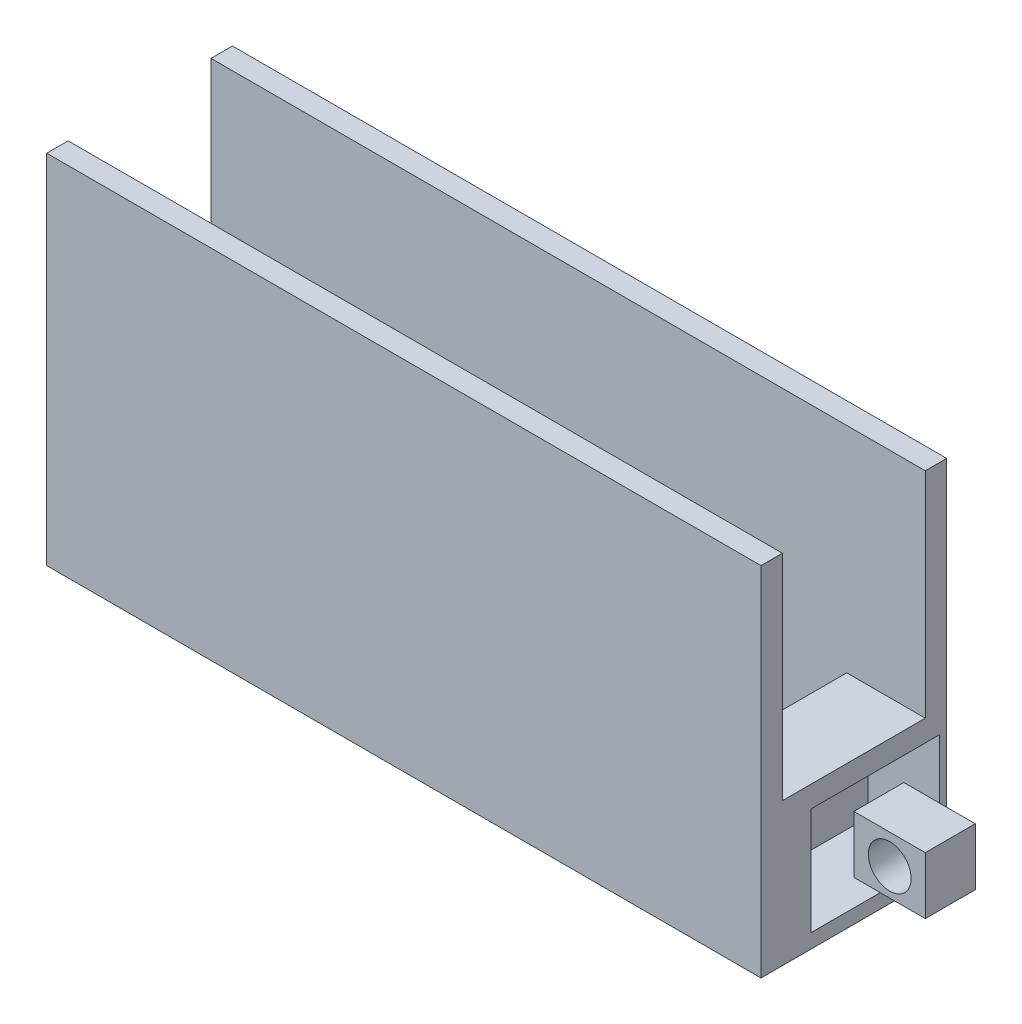
ISO-10303-21;
HEADER;
FILE_DESCRIPTION(('STEP AP214'),'2;1');
FILE_NAME('part.step','',(''),(''),'','','');
FILE_SCHEMA(('AUTOMOTIVE_DESIGN { 1 0 10303 214 1 1 1 1 }'));
ENDSEC;
DATA;
#1=APPLICATION_CONTEXT('core data for automotive mechanical design processes');
#2=APPLICATION_PROTOCOL_DEFINITION('international standard','automotive_design',2000,#1);
#3=PRODUCT_CONTEXT('',#1,'mechanical');
#4=PRODUCT('Part','Part','',(#3));
#5=PRODUCT_RELATED_PRODUCT_CATEGORY('part','',(#4));
#6=PRODUCT_DEFINITION_FORMATION('','',#4);
#7=PRODUCT_DEFINITION_CONTEXT('part definition',#1,'design');
#8=PRODUCT_DEFINITION('design','',#6,#7);
#9=PRODUCT_DEFINITION_SHAPE('','',#8);
#10=(LENGTH_UNIT() NAMED_UNIT(*) SI_UNIT(.MILLI.,.METRE.));
#11=(NAMED_UNIT(*) PLANE_ANGLE_UNIT() SI_UNIT($,.RADIAN.));
#12=(NAMED_UNIT(*) SI_UNIT($,.STERADIAN.) SOLID_ANGLE_UNIT());
#13=UNCERTAINTY_MEASURE_WITH_UNIT(LENGTH_MEASURE(1.E-05),#10,'distance_accuracy_value','');
#14=(GEOMETRIC_REPRESENTATION_CONTEXT(3) GLOBAL_UNCERTAINTY_ASSIGNED_CONTEXT((#13)) GLOBAL_UNIT_ASSIGNED_CONTEXT((#10,
#11,#12)) REPRESENTATION_CONTEXT('',''));
#15=CARTESIAN_POINT('',(0.,0.,0.));
#16=DIRECTION('',(0.,0.,1.));
#17=DIRECTION('',(1.,0.,0.));
#18=AXIS2_PLACEMENT_3D('',#15,#16,#17);
#19=CARTESIAN_POINT('',(0.,2.,0.));
#20=DIRECTION('',(0.,1.,0.));
#21=DIRECTION('',(0.,0.,1.));
#22=AXIS2_PLACEMENT_3D('',#19,#20,#21);
#23=PLANE('',#22);
#24=DIRECTION('',(-1.,0.,0.));
#25=VECTOR('',#24,1.);
#26=CARTESIAN_POINT('',(12.5280387960091,2.,0.3));
#27=LINE('',#26,#25);
#28=CARTESIAN_POINT('',(22.5280387960091,2.,0.3));
#29=VERTEX_POINT('',#28);
#30=CARTESIAN_POINT('',(21.4280387960091,2.,0.299999999999994));
#31=VERTEX_POINT('',#30);
#32=EDGE_CURVE('E216',#29,#31,#27,.T.);
#33=ORIENTED_EDGE('',*,*,#32,.T.);
#34=DIRECTION('',(0.,0.,-1.));
#35=VECTOR('',#34,1.);
#36=CARTESIAN_POINT('',(21.4280387960091,2.,0.4));
#37=LINE('',#36,#35);
#38=CARTESIAN_POINT('',(21.4280387960091,2.,2.29999999999999));
#39=VERTEX_POINT('',#38);
#40=EDGE_CURVE('E278',#39,#31,#37,.T.);
#41=ORIENTED_EDGE('',*,*,#40,.F.);
#42=DIRECTION('',(1.,0.,0.));
#43=VECTOR('',#42,1.);
#44=CARTESIAN_POINT('',(12.5280387960091,2.,2.3));
#45=LINE('',#44,#43);
#46=CARTESIAN_POINT('',(22.5280387960091,2.,2.3));
#47=VERTEX_POINT('',#46);
#48=EDGE_CURVE('E209',#39,#47,#45,.T.);
#49=ORIENTED_EDGE('',*,*,#48,.T.);
#50=DIRECTION('',(0.,0.,-1.));
#51=VECTOR('',#50,1.);
#52=CARTESIAN_POINT('',(22.5280387960091,2.,0.3));
#53=LINE('',#52,#51);
#54=EDGE_CURVE('E220',#47,#29,#53,.T.);
#55=ORIENTED_EDGE('',*,*,#54,.T.);
#56=EDGE_LOOP('',(#33,#41,#49,#55));
#57=FACE_BOUND('',#56,.T.);
#58=ADVANCED_FACE('F43',(#57),#23,.T.);
#59=CARTESIAN_POINT('',(22.5280387960091,7.,0.));
#60=DIRECTION('',(-1.,0.,0.));
#61=DIRECTION('',(0.,0.,1.));
#62=AXIS2_PLACEMENT_3D('',#59,#60,#61);
#63=PLANE('',#62);
#64=DIRECTION('',(0.,0.,-1.));
#65=VECTOR('',#64,1.);
#66=CARTESIAN_POINT('',(22.5280387960091,0.2,1.9));
#67=LINE('',#66,#65);
#68=CARTESIAN_POINT('',(22.5280387960091,0.2,1.9));
#69=VERTEX_POINT('',#68);
#70=CARTESIAN_POINT('',(22.5280387960091,0.2,0.0999999999999998));
#71=VERTEX_POINT('',#70);
#72=EDGE_CURVE('E227',#69,#71,#67,.T.);
#73=ORIENTED_EDGE('',*,*,#72,.F.);
#74=DIRECTION('',(0.,-1.,0.));
#75=VECTOR('',#74,1.);
#76=CARTESIAN_POINT('',(22.5280387960091,1.7,1.9));
#77=LINE('',#76,#75);
#78=CARTESIAN_POINT('',(22.5280387960091,1.7,1.9));
#79=VERTEX_POINT('',#78);
#80=EDGE_CURVE('E219',#79,#69,#77,.T.);
#81=ORIENTED_EDGE('',*,*,#80,.F.);
#82=DIRECTION('',(0.,0.,1.));
#83=VECTOR('',#82,1.);
#84=CARTESIAN_POINT('',(22.5280387960091,1.7,1.9));
#85=LINE('',#84,#83);
#86=CARTESIAN_POINT('',(22.5280387960091,1.7,0.1));
#87=VERTEX_POINT('',#86);
#88=EDGE_CURVE('E233',#87,#79,#85,.T.);
#89=ORIENTED_EDGE('',*,*,#88,.F.);
#90=DIRECTION('',(0.,1.,0.));
#91=VECTOR('',#90,1.);
#92=CARTESIAN_POINT('',(22.5280387960091,1.7,0.1));
#93=LINE('',#92,#91);
#94=EDGE_CURVE('E230',#71,#87,#93,.T.);
#95=ORIENTED_EDGE('',*,*,#94,.F.);
#96=EDGE_LOOP('',(#73,#81,#89,#95));
#97=FACE_BOUND('',#96,.T.);
#98=DIRECTION('',(0.,-1.,0.));
#99=VECTOR('',#98,1.);
#100=CARTESIAN_POINT('',(22.5280387960091,7.,0.));
#101=LINE('',#100,#99);
#102=CARTESIAN_POINT('',(22.5280387960091,5.,0.));
#103=VERTEX_POINT('',#102);
#104=CARTESIAN_POINT('',(22.5280387960091,0.,0.));
#105=VERTEX_POINT('',#104);
#106=EDGE_CURVE('E179',#103,#105,#101,.T.);
#107=ORIENTED_EDGE('',*,*,#106,.F.);
#108=DIRECTION('',(0.,0.,-1.));
#109=VECTOR('',#108,1.);
#110=CARTESIAN_POINT('',(22.5280387960091,5.,10.));
#111=LINE('',#110,#109);
#112=CARTESIAN_POINT('',(22.5280387960091,5.,0.3));
#113=VERTEX_POINT('',#112);
#114=EDGE_CURVE('E165',#113,#103,#111,.T.);
#115=ORIENTED_EDGE('',*,*,#114,.F.);
#116=DIRECTION('',(0.,1.,0.));
#117=VECTOR('',#116,1.);
#118=CARTESIAN_POINT('',(22.5280387960091,2.,0.3));
#119=LINE('',#118,#117);
#120=EDGE_CURVE('E187',#29,#113,#119,.T.);
#121=ORIENTED_EDGE('',*,*,#120,.F.);
#122=ORIENTED_EDGE('',*,*,#54,.F.);
#123=DIRECTION('',(0.,1.,0.));
#124=VECTOR('',#123,1.);
#125=CARTESIAN_POINT('',(22.5280387960091,2.,2.3));
#126=LINE('',#125,#124);
#127=CARTESIAN_POINT('',(22.5280387960091,5.,2.3));
#128=VERTEX_POINT('',#127);
#129=EDGE_CURVE('E210',#47,#128,#126,.T.);
#130=ORIENTED_EDGE('',*,*,#129,.T.);
#131=CARTESIAN_POINT('',(22.5280387960091,5.,2.6));
#132=VERTEX_POINT('',#131);
#133=EDGE_CURVE('E66',#132,#128,#111,.T.);
#134=ORIENTED_EDGE('',*,*,#133,.F.);
#135=DIRECTION('',(0.,-1.,0.));
#136=VECTOR('',#135,1.);
#137=CARTESIAN_POINT('',(22.5280387960091,7.,2.6));
#138=LINE('',#137,#136);
#139=CARTESIAN_POINT('',(22.5280387960091,0.,2.6));
#140=VERTEX_POINT('',#139);
#141=EDGE_CURVE('E196',#132,#140,#138,.T.);
#142=ORIENTED_EDGE('',*,*,#141,.T.);
#143=DIRECTION('',(0.,0.,-1.));
#144=VECTOR('',#143,1.);
#145=CARTESIAN_POINT('',(22.5280387960091,0.,0.));
#146=LINE('',#145,#144);
#147=EDGE_CURVE('E185',#140,#105,#146,.T.);
#148=ORIENTED_EDGE('',*,*,#147,.T.);
#149=EDGE_LOOP('',(#107,#115,#121,#122,#130,#134,#142,#148));
#150=FACE_BOUND('',#149,.T.);
#151=ADVANCED_FACE('F183',(#97,#150),#63,.F.);
#152=CARTESIAN_POINT('',(12.5280387960091,7.,0.));
#153=DIRECTION('',(1.,0.,0.));
#154=DIRECTION('',(0.,0.,-1.));
#155=AXIS2_PLACEMENT_3D('',#152,#153,#154);
#156=PLANE('',#155);
#157=DIRECTION('',(0.,-1.,0.));
#158=VECTOR('',#157,1.);
#159=CARTESIAN_POINT('',(12.5280387960091,7.,2.6));
#160=LINE('',#159,#158);
#161=CARTESIAN_POINT('',(12.5280387960091,5.,2.6));
#162=VERTEX_POINT('',#161);
#163=CARTESIAN_POINT('',(12.5280387960091,0.,2.6));
#164=VERTEX_POINT('',#163);
#165=EDGE_CURVE('E192',#162,#164,#160,.T.);
#166=ORIENTED_EDGE('',*,*,#165,.F.);
#167=DIRECTION('',(0.,0.,-1.));
#168=VECTOR('',#167,1.);
#169=CARTESIAN_POINT('',(12.5280387960091,5.,10.));
#170=LINE('',#169,#168);
#171=CARTESIAN_POINT('',(12.5280387960091,5.,2.3));
#172=VERTEX_POINT('',#171);
#173=EDGE_CURVE('E303',#162,#172,#170,.T.);
#174=ORIENTED_EDGE('',*,*,#173,.T.);
#175=DIRECTION('',(0.,1.,0.));
#176=VECTOR('',#175,1.);
#177=CARTESIAN_POINT('',(12.5280387960091,2.,2.3));
#178=LINE('',#177,#176);
#179=CARTESIAN_POINT('',(12.5280387960091,0.2,2.3));
#180=VERTEX_POINT('',#179);
#181=EDGE_CURVE('E190',#180,#172,#178,.T.);
#182=ORIENTED_EDGE('',*,*,#181,.F.);
#183=DIRECTION('',(0.,0.,1.));
#184=VECTOR('',#183,1.);
#185=CARTESIAN_POINT('',(12.5280387960091,0.2,0.3));
#186=LINE('',#185,#184);
#187=CARTESIAN_POINT('',(12.5280387960091,0.2,0.3));
#188=VERTEX_POINT('',#187);
#189=EDGE_CURVE('E308',#188,#180,#186,.T.);
#190=ORIENTED_EDGE('',*,*,#189,.F.);
#191=DIRECTION('',(0.,1.,0.));
#192=VECTOR('',#191,1.);
#193=CARTESIAN_POINT('',(12.5280387960091,2.,0.3));
#194=LINE('',#193,#192);
#195=CARTESIAN_POINT('',(12.5280387960091,5.,0.3));
#196=VERTEX_POINT('',#195);
#197=EDGE_CURVE('E199',#188,#196,#194,.T.);
#198=ORIENTED_EDGE('',*,*,#197,.T.);
#199=CARTESIAN_POINT('',(12.5280387960091,5.,0.));
#200=VERTEX_POINT('',#199);
#201=EDGE_CURVE('E58',#196,#200,#170,.T.);
#202=ORIENTED_EDGE('',*,*,#201,.T.);
#203=DIRECTION('',(0.,-1.,0.));
#204=VECTOR('',#203,1.);
#205=CARTESIAN_POINT('',(12.5280387960091,7.,0.));
#206=LINE('',#205,#204);
#207=CARTESIAN_POINT('',(12.5280387960091,0.,0.));
#208=VERTEX_POINT('',#207);
#209=EDGE_CURVE('E181',#200,#208,#206,.T.);
#210=ORIENTED_EDGE('',*,*,#209,.T.);
#211=DIRECTION('',(0.,0.,1.));
#212=VECTOR('',#211,1.);
#213=CARTESIAN_POINT('',(12.5280387960091,0.,0.));
#214=LINE('',#213,#212);
#215=EDGE_CURVE('E198',#208,#164,#214,.T.);
#216=ORIENTED_EDGE('',*,*,#215,.T.);
#217=EDGE_LOOP('',(#166,#174,#182,#190,#198,#202,#210,#216));
#218=FACE_BOUND('',#217,.T.);
#219=ADVANCED_FACE('F301',(#218),#156,.F.);
#220=CARTESIAN_POINT('',(12.5280387960091,7.,2.6));
#221=DIRECTION('',(0.,0.,-1.));
#222=DIRECTION('',(-1.,0.,0.));
#223=AXIS2_PLACEMENT_3D('',#220,#221,#222);
#224=PLANE('',#223);
#225=ORIENTED_EDGE('',*,*,#141,.F.);
#226=DIRECTION('',(-1.,0.,0.));
#227=VECTOR('',#226,1.);
#228=CARTESIAN_POINT('',(12.5280387960091,5.,2.6));
#229=LINE('',#228,#227);
#230=EDGE_CURVE('E295',#132,#162,#229,.T.);
#231=ORIENTED_EDGE('',*,*,#230,.T.);
#232=ORIENTED_EDGE('',*,*,#165,.T.);
#233=DIRECTION('',(1.,0.,0.));
#234=VECTOR('',#233,1.);
#235=CARTESIAN_POINT('',(12.5280387960091,0.,2.6));
#236=LINE('',#235,#234);
#237=EDGE_CURVE('E202',#164,#140,#236,.T.);
#238=ORIENTED_EDGE('',*,*,#237,.T.);
#239=EDGE_LOOP('',(#225,#231,#232,#238));
#240=FACE_BOUND('',#239,.T.);
#241=ADVANCED_FACE('F294',(#240),#224,.F.);
#242=CARTESIAN_POINT('',(12.5280387960091,7.,0.));
#243=DIRECTION('',(0.,0.,1.));
#244=DIRECTION('',(1.,0.,0.));
#245=AXIS2_PLACEMENT_3D('',#242,#243,#244);
#246=PLANE('',#245);
#247=ORIENTED_EDGE('',*,*,#209,.F.);
#248=DIRECTION('',(-1.,0.,0.));
#249=VECTOR('',#248,1.);
#250=CARTESIAN_POINT('',(22.5280387960091,5.,0.));
#251=LINE('',#250,#249);
#252=EDGE_CURVE('E168',#103,#200,#251,.T.);
#253=ORIENTED_EDGE('',*,*,#252,.F.);
#254=ORIENTED_EDGE('',*,*,#106,.T.);
#255=DIRECTION('',(-1.,0.,0.));
#256=VECTOR('',#255,1.);
#257=CARTESIAN_POINT('',(12.5280387960091,0.,0.));
#258=LINE('',#257,#256);
#259=EDGE_CURVE('E188',#105,#208,#258,.T.);
#260=ORIENTED_EDGE('',*,*,#259,.T.);
#261=EDGE_LOOP('',(#247,#253,#254,#260));
#262=FACE_BOUND('',#261,.T.);
#263=ADVANCED_FACE('F177',(#262),#246,.F.);
#264=CARTESIAN_POINT('',(0.,0.,0.));
#265=DIRECTION('',(0.,1.,0.));
#266=DIRECTION('',(0.,0.,1.));
#267=AXIS2_PLACEMENT_3D('',#264,#265,#266);
#268=PLANE('',#267);
#269=DIRECTION('',(-1.,0.,0.));
#270=VECTOR('',#269,1.);
#271=CARTESIAN_POINT('',(0.,0.,0.4));
#272=LINE('',#271,#270);
#273=CARTESIAN_POINT('',(21.4280387960091,0.,0.4));
#274=VERTEX_POINT('',#273);
#275=CARTESIAN_POINT('',(12.6280387960091,0.,0.4));
#276=VERTEX_POINT('',#275);
#277=EDGE_CURVE('E285',#274,#276,#272,.T.);
#278=ORIENTED_EDGE('',*,*,#277,.T.);
#279=DIRECTION('',(0.,0.,1.));
#280=VECTOR('',#279,1.);
#281=CARTESIAN_POINT('',(12.6280387960091,0.,0.));
#282=LINE('',#281,#280);
#283=CARTESIAN_POINT('',(12.6280387960091,0.,2.2));
#284=VERTEX_POINT('',#283);
#285=EDGE_CURVE('E212',#276,#284,#282,.T.);
#286=ORIENTED_EDGE('',*,*,#285,.T.);
#287=DIRECTION('',(1.,0.,0.));
#288=VECTOR('',#287,1.);
#289=CARTESIAN_POINT('',(0.,0.,2.2));
#290=LINE('',#289,#288);
#291=CARTESIAN_POINT('',(21.4280387960091,0.,2.2));
#292=VERTEX_POINT('',#291);
#293=EDGE_CURVE('E282',#284,#292,#290,.T.);
#294=ORIENTED_EDGE('',*,*,#293,.T.);
#295=DIRECTION('',(0.,0.,-1.));
#296=VECTOR('',#295,1.);
#297=CARTESIAN_POINT('',(21.4280387960091,0.,0.));
#298=LINE('',#297,#296);
#299=EDGE_CURVE('E271',#292,#274,#298,.T.);
#300=ORIENTED_EDGE('',*,*,#299,.T.);
#301=EDGE_LOOP('',(#278,#286,#294,#300));
#302=FACE_BOUND('',#301,.T.);
#303=ORIENTED_EDGE('',*,*,#215,.F.);
#304=ORIENTED_EDGE('',*,*,#259,.F.);
#305=ORIENTED_EDGE('',*,*,#147,.F.);
#306=ORIENTED_EDGE('',*,*,#237,.F.);
#307=EDGE_LOOP('',(#303,#304,#305,#306));
#308=FACE_BOUND('',#307,.T.);
#309=ADVANCED_FACE('F300',(#302,#308),#268,.F.);
#310=CARTESIAN_POINT('',(12.5280387960091,2.,0.3));
#311=DIRECTION('',(0.,0.,-1.));
#312=DIRECTION('',(-1.,0.,0.));
#313=AXIS2_PLACEMENT_3D('',#310,#311,#312);
#314=PLANE('',#313);
#315=ORIENTED_EDGE('',*,*,#120,.T.);
#316=DIRECTION('',(-1.,0.,0.));
#317=VECTOR('',#316,1.);
#318=CARTESIAN_POINT('',(12.5280387960091,5.,0.3));
#319=LINE('',#318,#317);
#320=EDGE_CURVE('E169',#113,#196,#319,.T.);
#321=ORIENTED_EDGE('',*,*,#320,.T.);
#322=ORIENTED_EDGE('',*,*,#197,.F.);
#323=DIRECTION('',(-1.,0.,0.));
#324=VECTOR('',#323,1.);
#325=CARTESIAN_POINT('',(21.4280387960091,0.2,0.299999999999994));
#326=LINE('',#325,#324);
#327=CARTESIAN_POINT('',(21.4280387960091,0.2,0.299999999999994));
#328=VERTEX_POINT('',#327);
#329=EDGE_CURVE('E317',#328,#188,#326,.T.);
#330=ORIENTED_EDGE('',*,*,#329,.F.);
#331=DIRECTION('',(0.,-1.,0.));
#332=VECTOR('',#331,1.);
#333=CARTESIAN_POINT('',(21.4280387960091,2.,0.299999999999994));
#334=LINE('',#333,#332);
#335=EDGE_CURVE('E309',#31,#328,#334,.T.);
#336=ORIENTED_EDGE('',*,*,#335,.F.);
#337=ORIENTED_EDGE('',*,*,#32,.F.);
#338=EDGE_LOOP('',(#315,#321,#322,#330,#336,#337));
#339=FACE_BOUND('',#338,.T.);
#340=ADVANCED_FACE('F338',(#339),#314,.F.);
#341=CARTESIAN_POINT('',(12.5280387960091,2.,2.3));
#342=DIRECTION('',(0.,0.,1.));
#343=DIRECTION('',(1.,0.,0.));
#344=AXIS2_PLACEMENT_3D('',#341,#342,#343);
#345=PLANE('',#344);
#346=ORIENTED_EDGE('',*,*,#181,.T.);
#347=DIRECTION('',(1.,0.,0.));
#348=VECTOR('',#347,1.);
#349=CARTESIAN_POINT('',(12.5280387960091,5.,2.3));
#350=LINE('',#349,#348);
#351=EDGE_CURVE('E12',#172,#128,#350,.T.);
#352=ORIENTED_EDGE('',*,*,#351,.T.);
#353=ORIENTED_EDGE('',*,*,#129,.F.);
#354=ORIENTED_EDGE('',*,*,#48,.F.);
#355=DIRECTION('',(0.,1.,0.));
#356=VECTOR('',#355,1.);
#357=CARTESIAN_POINT('',(21.4280387960091,2.,2.29999999999999));
#358=LINE('',#357,#356);
#359=CARTESIAN_POINT('',(21.4280387960091,0.2,2.29999999999999));
#360=VERTEX_POINT('',#359);
#361=EDGE_CURVE('E315',#360,#39,#358,.T.);
#362=ORIENTED_EDGE('',*,*,#361,.F.);
#363=DIRECTION('',(-1.,0.,0.));
#364=VECTOR('',#363,1.);
#365=CARTESIAN_POINT('',(21.4280387960091,0.2,2.29999999999999));
#366=LINE('',#365,#364);
#367=EDGE_CURVE('E320',#360,#180,#366,.T.);
#368=ORIENTED_EDGE('',*,*,#367,.T.);
#369=EDGE_LOOP('',(#346,#352,#353,#354,#362,#368));
#370=FACE_BOUND('',#369,.T.);
#371=ADVANCED_FACE('F344',(#370),#345,.F.);
#372=CARTESIAN_POINT('',(21.5280387960091,1.7,1.9));
#373=DIRECTION('',(0.,0.,1.));
#374=DIRECTION('',(0.,-1.,0.));
#375=AXIS2_PLACEMENT_3D('',#372,#373,#374);
#376=PLANE('',#375);
#377=ORIENTED_EDGE('',*,*,#80,.T.);
#378=DIRECTION('',(1.,0.,0.));
#379=VECTOR('',#378,1.);
#380=CARTESIAN_POINT('',(21.5280387960091,0.2,1.9));
#381=LINE('',#380,#379);
#382=CARTESIAN_POINT('',(21.5280387960091,0.2,1.9));
#383=VERTEX_POINT('',#382);
#384=EDGE_CURVE('E223',#383,#69,#381,.T.);
#385=ORIENTED_EDGE('',*,*,#384,.F.);
#386=DIRECTION('',(0.,-1.,0.));
#387=VECTOR('',#386,1.);
#388=CARTESIAN_POINT('',(21.5280387960091,1.7,1.9));
#389=LINE('',#388,#387);
#390=CARTESIAN_POINT('',(21.5280387960091,1.7,1.9));
#391=VERTEX_POINT('',#390);
#392=EDGE_CURVE('E226',#391,#383,#389,.T.);
#393=ORIENTED_EDGE('',*,*,#392,.F.);
#394=DIRECTION('',(1.,0.,0.));
#395=VECTOR('',#394,1.);
#396=CARTESIAN_POINT('',(21.5280387960091,1.7,1.9));
#397=LINE('',#396,#395);
#398=EDGE_CURVE('E234',#391,#79,#397,.T.);
#399=ORIENTED_EDGE('',*,*,#398,.T.);
#400=EDGE_LOOP('',(#377,#385,#393,#399));
#401=FACE_BOUND('',#400,.T.);
#402=ADVANCED_FACE('F358',(#401),#376,.F.);
#403=CARTESIAN_POINT('',(21.5280387960091,1.7,1.9));
#404=DIRECTION('',(0.,1.,0.));
#405=DIRECTION('',(0.,0.,1.));
#406=AXIS2_PLACEMENT_3D('',#403,#404,#405);
#407=PLANE('',#406);
#408=ORIENTED_EDGE('',*,*,#88,.T.);
#409=ORIENTED_EDGE('',*,*,#398,.F.);
#410=DIRECTION('',(0.,0.,1.));
#411=VECTOR('',#410,1.);
#412=CARTESIAN_POINT('',(21.5280387960091,1.7,1.9));
#413=LINE('',#412,#411);
#414=CARTESIAN_POINT('',(21.5280387960091,1.7,0.1));
#415=VERTEX_POINT('',#414);
#416=EDGE_CURVE('E243',#415,#391,#413,.T.);
#417=ORIENTED_EDGE('',*,*,#416,.F.);
#418=DIRECTION('',(1.,0.,0.));
#419=VECTOR('',#418,1.);
#420=CARTESIAN_POINT('',(21.5280387960091,1.7,0.1));
#421=LINE('',#420,#419);
#422=EDGE_CURVE('E231',#415,#87,#421,.T.);
#423=ORIENTED_EDGE('',*,*,#422,.T.);
#424=EDGE_LOOP('',(#408,#409,#417,#423));
#425=FACE_BOUND('',#424,.T.);
#426=ADVANCED_FACE('F361',(#425),#407,.F.);
#427=CARTESIAN_POINT('',(21.5280387960091,1.7,0.1));
#428=DIRECTION('',(0.,0.,-1.));
#429=DIRECTION('',(0.,1.,0.));
#430=AXIS2_PLACEMENT_3D('',#427,#428,#429);
#431=PLANE('',#430);
#432=ORIENTED_EDGE('',*,*,#94,.T.);
#433=ORIENTED_EDGE('',*,*,#422,.F.);
#434=DIRECTION('',(0.,1.,0.));
#435=VECTOR('',#434,1.);
#436=CARTESIAN_POINT('',(21.5280387960091,1.7,0.1));
#437=LINE('',#436,#435);
#438=CARTESIAN_POINT('',(21.5280387960091,0.2,0.0999999999999998));
#439=VERTEX_POINT('',#438);
#440=EDGE_CURVE('E246',#439,#415,#437,.T.);
#441=ORIENTED_EDGE('',*,*,#440,.F.);
#442=DIRECTION('',(1.,0.,0.));
#443=VECTOR('',#442,1.);
#444=CARTESIAN_POINT('',(21.5280387960091,0.2,0.0999999999999998));
#445=LINE('',#444,#443);
#446=EDGE_CURVE('E228',#439,#71,#445,.T.);
#447=ORIENTED_EDGE('',*,*,#446,.T.);
#448=EDGE_LOOP('',(#432,#433,#441,#447));
#449=FACE_BOUND('',#448,.T.);
#450=ADVANCED_FACE('F366',(#449),#431,.F.);
#451=CARTESIAN_POINT('',(21.5280387960091,0.2,1.9));
#452=DIRECTION('',(0.,-1.,0.));
#453=DIRECTION('',(0.,0.,-1.));
#454=AXIS2_PLACEMENT_3D('',#451,#452,#453);
#455=PLANE('',#454);
#456=ORIENTED_EDGE('',*,*,#72,.T.);
#457=ORIENTED_EDGE('',*,*,#446,.F.);
#458=DIRECTION('',(0.,0.,-1.));
#459=VECTOR('',#458,1.);
#460=CARTESIAN_POINT('',(21.5280387960091,0.2,1.9));
#461=LINE('',#460,#459);
#462=EDGE_CURVE('E249',#383,#439,#461,.T.);
#463=ORIENTED_EDGE('',*,*,#462,.F.);
#464=ORIENTED_EDGE('',*,*,#384,.T.);
#465=EDGE_LOOP('',(#456,#457,#463,#464));
#466=FACE_BOUND('',#465,.T.);
#467=ADVANCED_FACE('F363',(#466),#455,.F.);
#468=CARTESIAN_POINT('',(21.5280387960091,0.,0.));
#469=DIRECTION('',(1.,0.,0.));
#470=DIRECTION('',(0.,0.,-1.));
#471=AXIS2_PLACEMENT_3D('',#468,#469,#470);
#472=PLANE('',#471);
#473=ORIENTED_EDGE('',*,*,#392,.T.);
#474=ORIENTED_EDGE('',*,*,#462,.T.);
#475=ORIENTED_EDGE('',*,*,#440,.T.);
#476=ORIENTED_EDGE('',*,*,#416,.T.);
#477=EDGE_LOOP('',(#473,#474,#475,#476));
#478=FACE_BOUND('',#477,.T.);
#479=ADVANCED_FACE('F45',(#478),#472,.T.);
#480=CARTESIAN_POINT('',(12.6280387960091,-8.,0.4));
#481=DIRECTION('',(-1.,0.,0.));
#482=DIRECTION('',(0.,0.,1.));
#483=AXIS2_PLACEMENT_3D('',#480,#481,#482);
#484=PLANE('',#483);
#485=DIRECTION('',(0.,1.,0.));
#486=VECTOR('',#485,1.);
#487=CARTESIAN_POINT('',(12.6280387960091,-8.,0.4));
#488=LINE('',#487,#486);
#489=CARTESIAN_POINT('',(12.6280387960091,0.200000000000001,0.4));
#490=VERTEX_POINT('',#489);
#491=EDGE_CURVE('E276',#276,#490,#488,.T.);
#492=ORIENTED_EDGE('',*,*,#491,.T.);
#493=DIRECTION('',(0.,0.,1.));
#494=VECTOR('',#493,1.);
#495=CARTESIAN_POINT('',(12.6280387960091,0.200000000000001,0.4));
#496=LINE('',#495,#494);
#497=CARTESIAN_POINT('',(12.6280387960091,0.200000000000001,2.2));
#498=VERTEX_POINT('',#497);
#499=EDGE_CURVE('E323',#490,#498,#496,.T.);
#500=ORIENTED_EDGE('',*,*,#499,.T.);
#501=DIRECTION('',(0.,1.,0.));
#502=VECTOR('',#501,1.);
#503=CARTESIAN_POINT('',(12.6280387960091,-8.,2.2));
#504=LINE('',#503,#502);
#505=EDGE_CURVE('E261',#284,#498,#504,.T.);
#506=ORIENTED_EDGE('',*,*,#505,.F.);
#507=ORIENTED_EDGE('',*,*,#285,.F.);
#508=EDGE_LOOP('',(#492,#500,#506,#507));
#509=FACE_BOUND('',#508,.T.);
#510=ADVANCED_FACE('F333',(#509),#484,.F.);
#511=CARTESIAN_POINT('',(12.6280387960091,-8.,0.4));
#512=DIRECTION('',(0.,0.,-1.));
#513=DIRECTION('',(-1.,0.,0.));
#514=AXIS2_PLACEMENT_3D('',#511,#512,#513);
#515=PLANE('',#514);
#516=DIRECTION('',(0.,1.,0.));
#517=VECTOR('',#516,1.);
#518=CARTESIAN_POINT('',(21.4280387960091,-8.,0.4));
#519=LINE('',#518,#517);
#520=CARTESIAN_POINT('',(21.4280387960091,0.2,0.4));
#521=VERTEX_POINT('',#520);
#522=EDGE_CURVE('E273',#274,#521,#519,.T.);
#523=ORIENTED_EDGE('',*,*,#522,.T.);
#524=DIRECTION('',(-1.,0.,0.));
#525=VECTOR('',#524,1.);
#526=CARTESIAN_POINT('',(12.6280387960091,0.200000000000001,0.4));
#527=LINE('',#526,#525);
#528=EDGE_CURVE('E327',#521,#490,#527,.T.);
#529=ORIENTED_EDGE('',*,*,#528,.T.);
#530=ORIENTED_EDGE('',*,*,#491,.F.);
#531=ORIENTED_EDGE('',*,*,#277,.F.);
#532=EDGE_LOOP('',(#523,#529,#530,#531));
#533=FACE_BOUND('',#532,.T.);
#534=ADVANCED_FACE('F335',(#533),#515,.F.);
#535=CARTESIAN_POINT('',(21.4280387960091,-8.,0.4));
#536=DIRECTION('',(1.,0.,0.));
#537=DIRECTION('',(0.,0.,-1.));
#538=AXIS2_PLACEMENT_3D('',#535,#536,#537);
#539=PLANE('',#538);
#540=DIRECTION('',(0.,1.,0.));
#541=VECTOR('',#540,1.);
#542=CARTESIAN_POINT('',(21.4280387960091,-8.,2.2));
#543=LINE('',#542,#541);
#544=CARTESIAN_POINT('',(21.4280387960091,0.2,2.2));
#545=VERTEX_POINT('',#544);
#546=EDGE_CURVE('E258',#292,#545,#543,.T.);
#547=ORIENTED_EDGE('',*,*,#546,.T.);
#548=DIRECTION('',(0.,0.,1.));
#549=VECTOR('',#548,1.);
#550=CARTESIAN_POINT('',(21.4280387960091,0.2,0.299999999999994));
#551=LINE('',#550,#549);
#552=EDGE_CURVE('E267',#545,#360,#551,.T.);
#553=ORIENTED_EDGE('',*,*,#552,.T.);
#554=ORIENTED_EDGE('',*,*,#361,.T.);
#555=ORIENTED_EDGE('',*,*,#40,.T.);
#556=ORIENTED_EDGE('',*,*,#335,.T.);
#557=EDGE_CURVE('E312',#328,#521,#551,.T.);
#558=ORIENTED_EDGE('',*,*,#557,.T.);
#559=ORIENTED_EDGE('',*,*,#522,.F.);
#560=ORIENTED_EDGE('',*,*,#299,.F.);
#561=EDGE_LOOP('',(#547,#553,#554,#555,#556,#558,#559,#560));
#562=FACE_BOUND('',#561,.T.);
#563=ADVANCED_FACE('F265',(#562),#539,.F.);
#564=CARTESIAN_POINT('',(12.6280387960091,-8.,2.2));
#565=DIRECTION('',(0.,0.,1.));
#566=DIRECTION('',(1.,0.,0.));
#567=AXIS2_PLACEMENT_3D('',#564,#565,#566);
#568=PLANE('',#567);
#569=ORIENTED_EDGE('',*,*,#505,.T.);
#570=DIRECTION('',(1.,0.,0.));
#571=VECTOR('',#570,1.);
#572=CARTESIAN_POINT('',(12.6280387960091,0.200000000000001,2.2));
#573=LINE('',#572,#571);
#574=EDGE_CURVE('E51',#498,#545,#573,.T.);
#575=ORIENTED_EDGE('',*,*,#574,.T.);
#576=ORIENTED_EDGE('',*,*,#546,.F.);
#577=ORIENTED_EDGE('',*,*,#293,.F.);
#578=EDGE_LOOP('',(#569,#575,#576,#577));
#579=FACE_BOUND('',#578,.T.);
#580=ADVANCED_FACE('F257',(#579),#568,.F.);
#581=CARTESIAN_POINT('',(21.4280387960091,0.2,0.299999999999994));
#582=DIRECTION('',(0.,-1.,0.));
#583=DIRECTION('',(0.,0.,-1.));
#584=AXIS2_PLACEMENT_3D('',#581,#582,#583);
#585=PLANE('',#584);
#586=ORIENTED_EDGE('',*,*,#557,.F.);
#587=ORIENTED_EDGE('',*,*,#329,.T.);
#588=ORIENTED_EDGE('',*,*,#189,.T.);
#589=ORIENTED_EDGE('',*,*,#367,.F.);
#590=ORIENTED_EDGE('',*,*,#552,.F.);
#591=ORIENTED_EDGE('',*,*,#574,.F.);
#592=ORIENTED_EDGE('',*,*,#499,.F.);
#593=ORIENTED_EDGE('',*,*,#528,.F.);
#594=EDGE_LOOP('',(#586,#587,#588,#589,#590,#591,#592,#593));
#595=FACE_BOUND('',#594,.T.);
#596=ADVANCED_FACE('F435',(#595),#585,.F.);
#597=CARTESIAN_POINT('',(22.5280387960091,5.,10.));
#598=DIRECTION('',(0.,-1.,0.));
#599=DIRECTION('',(0.,0.,-1.));
#600=AXIS2_PLACEMENT_3D('',#597,#598,#599);
#601=PLANE('',#600);
#602=ORIENTED_EDGE('',*,*,#133,.T.);
#603=ORIENTED_EDGE('',*,*,#351,.F.);
#604=ORIENTED_EDGE('',*,*,#173,.F.);
#605=ORIENTED_EDGE('',*,*,#230,.F.);
#606=EDGE_LOOP('',(#602,#603,#604,#605));
#607=FACE_BOUND('',#606,.T.);
#608=ADVANCED_FACE('F430',(#607),#601,.F.);
#609=ORIENTED_EDGE('',*,*,#114,.T.);
#610=ORIENTED_EDGE('',*,*,#252,.T.);
#611=ORIENTED_EDGE('',*,*,#201,.F.);
#612=ORIENTED_EDGE('',*,*,#320,.F.);
#613=EDGE_LOOP('',(#609,#610,#611,#612));
#614=FACE_BOUND('',#613,.T.);
#615=ADVANCED_FACE('F167',(#614),#601,.F.);
#616=CLOSED_SHELL('',(#58,#151,#219,#241,#263,#309,#340,#371,#402,#426,#450,#467,#479,#510,#534,
#563,#580,#596,#608,#615));
#617=MANIFOLD_SOLID_BREP('B2',#616);
#618=CARTESIAN_POINT('',(23.030317852936,0.955099211609965,0.300000000000001));
#619=DIRECTION('',(0.,0.,1.));
#620=DIRECTION('',(1.,0.,0.));
#621=AXIS2_PLACEMENT_3D('',#618,#619,#620);
#622=CYLINDRICAL_SURFACE('',#621,0.3);
#623=CARTESIAN_POINT('',(23.030317852936,0.955099211609965,1.3));
#624=DIRECTION('',(0.,0.,1.));
#625=DIRECTION('',(1.,0.,0.));
#626=AXIS2_PLACEMENT_3D('',#623,#624,#625);
#627=CIRCLE('',#626,0.3);
#628=CARTESIAN_POINT('',(23.330317852936,0.955099211609965,1.3));
#629=VERTEX_POINT('',#628);
#630=EDGE_CURVE('E611',#629,#629,#627,.T.);
#631=ORIENTED_EDGE('',*,*,#630,.T.);
#632=EDGE_LOOP('',(#631));
#633=FACE_BOUND('',#632,.T.);
#634=CARTESIAN_POINT('',(23.030317852936,0.955099211609965,0.600000000000001));
#635=DIRECTION('',(0.,0.,1.));
#636=DIRECTION('',(0.,-1.,0.));
#637=AXIS2_PLACEMENT_3D('',#634,#635,#636);
#638=CIRCLE('',#637,0.3);
#639=CARTESIAN_POINT('',(23.030317852936,0.655099211609965,0.600000000000001));
#640=VERTEX_POINT('',#639);
#641=EDGE_CURVE('E542',#640,#640,#638,.T.);
#642=ORIENTED_EDGE('',*,*,#641,.F.);
#643=EDGE_LOOP('',(#642));
#644=FACE_BOUND('',#643,.T.);
#645=ADVANCED_FACE('F538',(#633,#644),#622,.F.);
#646=CARTESIAN_POINT('',(23.5280387960091,0.,0.));
#647=DIRECTION('',(-1.,0.,0.));
#648=DIRECTION('',(0.,0.,1.));
#649=AXIS2_PLACEMENT_3D('',#646,#647,#648);
#650=PLANE('',#649);
#651=DIRECTION('',(0.,-1.,0.));
#652=VECTOR('',#651,1.);
#653=CARTESIAN_POINT('',(23.5280387960091,0.57,1.3));
#654=LINE('',#653,#652);
#655=CARTESIAN_POINT('',(23.5280387960091,1.37,1.3));
#656=VERTEX_POINT('',#655);
#657=CARTESIAN_POINT('',(23.5280387960091,0.57,1.3));
#658=VERTEX_POINT('',#657);
#659=EDGE_CURVE('E586',#656,#658,#654,.T.);
#660=ORIENTED_EDGE('',*,*,#659,.T.);
#661=DIRECTION('',(0.,0.,-1.));
#662=VECTOR('',#661,1.);
#663=CARTESIAN_POINT('',(23.5280387960091,0.57,1.3));
#664=LINE('',#663,#662);
#665=CARTESIAN_POINT('',(23.5280387960091,0.57,0.600000000000001));
#666=VERTEX_POINT('',#665);
#667=EDGE_CURVE('E608',#658,#666,#664,.T.);
#668=ORIENTED_EDGE('',*,*,#667,.T.);
#669=DIRECTION('',(0.,1.,0.));
#670=VECTOR('',#669,1.);
#671=CARTESIAN_POINT('',(23.5280387960091,0.57,0.600000000000001));
#672=LINE('',#671,#670);
#673=CARTESIAN_POINT('',(23.5280387960091,1.37,0.600000000000001));
#674=VERTEX_POINT('',#673);
#675=EDGE_CURVE('E606',#666,#674,#672,.T.);
#676=ORIENTED_EDGE('',*,*,#675,.T.);
#677=DIRECTION('',(0.,0.,1.));
#678=VECTOR('',#677,1.);
#679=CARTESIAN_POINT('',(23.5280387960091,1.37,1.3));
#680=LINE('',#679,#678);
#681=EDGE_CURVE('E555',#674,#656,#680,.T.);
#682=ORIENTED_EDGE('',*,*,#681,.T.);
#683=EDGE_LOOP('',(#660,#668,#676,#682));
#684=FACE_BOUND('',#683,.T.);
#685=ADVANCED_FACE('F620',(#684),#650,.F.);
#686=CARTESIAN_POINT('',(23.5280387960091,1.37,1.3));
#687=DIRECTION('',(0.,-1.,0.));
#688=DIRECTION('',(0.,0.,-1.));
#689=AXIS2_PLACEMENT_3D('',#686,#687,#688);
#690=PLANE('',#689);
#691=DIRECTION('',(0.,0.,1.));
#692=VECTOR('',#691,1.);
#693=CARTESIAN_POINT('',(22.5280387960091,1.37,1.3));
#694=LINE('',#693,#692);
#695=CARTESIAN_POINT('',(22.5280387960091,1.37,0.600000000000001));
#696=VERTEX_POINT('',#695);
#697=CARTESIAN_POINT('',(22.5280387960091,1.37,1.3));
#698=VERTEX_POINT('',#697);
#699=EDGE_CURVE('E576',#696,#698,#694,.T.);
#700=ORIENTED_EDGE('',*,*,#699,.T.);
#701=DIRECTION('',(-1.,0.,0.));
#702=VECTOR('',#701,1.);
#703=CARTESIAN_POINT('',(23.5280387960091,1.37,1.3));
#704=LINE('',#703,#702);
#705=EDGE_CURVE('E598',#656,#698,#704,.T.);
#706=ORIENTED_EDGE('',*,*,#705,.F.);
#707=ORIENTED_EDGE('',*,*,#681,.F.);
#708=DIRECTION('',(-1.,0.,0.));
#709=VECTOR('',#708,1.);
#710=CARTESIAN_POINT('',(23.5280387960091,1.37,0.600000000000001));
#711=LINE('',#710,#709);
#712=EDGE_CURVE('E593',#674,#696,#711,.T.);
#713=ORIENTED_EDGE('',*,*,#712,.T.);
#714=EDGE_LOOP('',(#700,#706,#707,#713));
#715=FACE_BOUND('',#714,.T.);
#716=ADVANCED_FACE('F597',(#715),#690,.F.);
#717=CARTESIAN_POINT('',(23.5280387960091,0.57,0.600000000000001));
#718=DIRECTION('',(0.,0.,1.));
#719=DIRECTION('',(0.,-1.,0.));
#720=AXIS2_PLACEMENT_3D('',#717,#718,#719);
#721=PLANE('',#720);
#722=ORIENTED_EDGE('',*,*,#641,.T.);
#723=EDGE_LOOP('',(#722));
#724=FACE_BOUND('',#723,.T.);
#725=DIRECTION('',(0.,1.,0.));
#726=VECTOR('',#725,1.);
#727=CARTESIAN_POINT('',(22.5280387960091,0.57,0.600000000000001));
#728=LINE('',#727,#726);
#729=CARTESIAN_POINT('',(22.5280387960091,0.57,0.600000000000001));
#730=VERTEX_POINT('',#729);
#731=EDGE_CURVE('E579',#730,#696,#728,.T.);
#732=ORIENTED_EDGE('',*,*,#731,.T.);
#733=ORIENTED_EDGE('',*,*,#712,.F.);
#734=ORIENTED_EDGE('',*,*,#675,.F.);
#735=DIRECTION('',(-1.,0.,0.));
#736=VECTOR('',#735,1.);
#737=CARTESIAN_POINT('',(23.5280387960091,0.57,0.600000000000001));
#738=LINE('',#737,#736);
#739=EDGE_CURVE('E548',#666,#730,#738,.T.);
#740=ORIENTED_EDGE('',*,*,#739,.T.);
#741=EDGE_LOOP('',(#732,#733,#734,#740));
#742=FACE_BOUND('',#741,.T.);
#743=ADVANCED_FACE('F591',(#724,#742),#721,.F.);
#744=CARTESIAN_POINT('',(23.5280387960091,0.57,1.3));
#745=DIRECTION('',(0.,1.,0.));
#746=DIRECTION('',(0.,0.,1.));
#747=AXIS2_PLACEMENT_3D('',#744,#745,#746);
#748=PLANE('',#747);
#749=DIRECTION('',(0.,0.,-1.));
#750=VECTOR('',#749,1.);
#751=CARTESIAN_POINT('',(22.5280387960091,0.57,1.3));
#752=LINE('',#751,#750);
#753=CARTESIAN_POINT('',(22.5280387960091,0.57,1.3));
#754=VERTEX_POINT('',#753);
#755=EDGE_CURVE('E595',#754,#730,#752,.T.);
#756=ORIENTED_EDGE('',*,*,#755,.T.);
#757=ORIENTED_EDGE('',*,*,#739,.F.);
#758=ORIENTED_EDGE('',*,*,#667,.F.);
#759=DIRECTION('',(-1.,0.,0.));
#760=VECTOR('',#759,1.);
#761=CARTESIAN_POINT('',(23.5280387960091,0.57,1.3));
#762=LINE('',#761,#760);
#763=EDGE_CURVE('E41',#658,#754,#762,.T.);
#764=ORIENTED_EDGE('',*,*,#763,.T.);
#765=EDGE_LOOP('',(#756,#757,#758,#764));
#766=FACE_BOUND('',#765,.T.);
#767=ADVANCED_FACE('F631',(#766),#748,.F.);
#768=CARTESIAN_POINT('',(23.5280387960091,0.57,1.3));
#769=DIRECTION('',(0.,0.,-1.));
#770=DIRECTION('',(0.,1.,0.));
#771=AXIS2_PLACEMENT_3D('',#768,#769,#770);
#772=PLANE('',#771);
#773=ORIENTED_EDGE('',*,*,#630,.F.);
#774=EDGE_LOOP('',(#773));
#775=FACE_BOUND('',#774,.T.);
#776=DIRECTION('',(0.,-1.,0.));
#777=VECTOR('',#776,1.);
#778=CARTESIAN_POINT('',(22.5280387960091,0.57,1.3));
#779=LINE('',#778,#777);
#780=EDGE_CURVE('E582',#698,#754,#779,.T.);
#781=ORIENTED_EDGE('',*,*,#780,.T.);
#782=ORIENTED_EDGE('',*,*,#763,.F.);
#783=ORIENTED_EDGE('',*,*,#659,.F.);
#784=ORIENTED_EDGE('',*,*,#705,.T.);
#785=EDGE_LOOP('',(#781,#782,#783,#784));
#786=FACE_BOUND('',#785,.T.);
#787=ADVANCED_FACE('F540',(#775,#786),#772,.F.);
#788=CARTESIAN_POINT('',(22.5280387960091,0.,0.));
#789=DIRECTION('',(1.,0.,0.));
#790=DIRECTION('',(0.,0.,-1.));
#791=AXIS2_PLACEMENT_3D('',#788,#789,#790);
#792=PLANE('',#791);
#793=ORIENTED_EDGE('',*,*,#699,.F.);
#794=ORIENTED_EDGE('',*,*,#731,.F.);
#795=ORIENTED_EDGE('',*,*,#755,.F.);
#796=ORIENTED_EDGE('',*,*,#780,.F.);
#797=EDGE_LOOP('',(#793,#794,#795,#796));
#798=FACE_BOUND('',#797,.T.);
#799=ADVANCED_FACE('F578',(#798),#792,.F.);
#800=CLOSED_SHELL('',(#645,#685,#716,#743,#767,#787,#799));
#801=MANIFOLD_SOLID_BREP('B6',#800);
#802=ADVANCED_BREP_SHAPE_REPRESENTATION('',(#18,#617,#801),#14);
#803=SHAPE_DEFINITION_REPRESENTATION(#9,#802);
ENDSEC;
END-ISO-10303-21;
